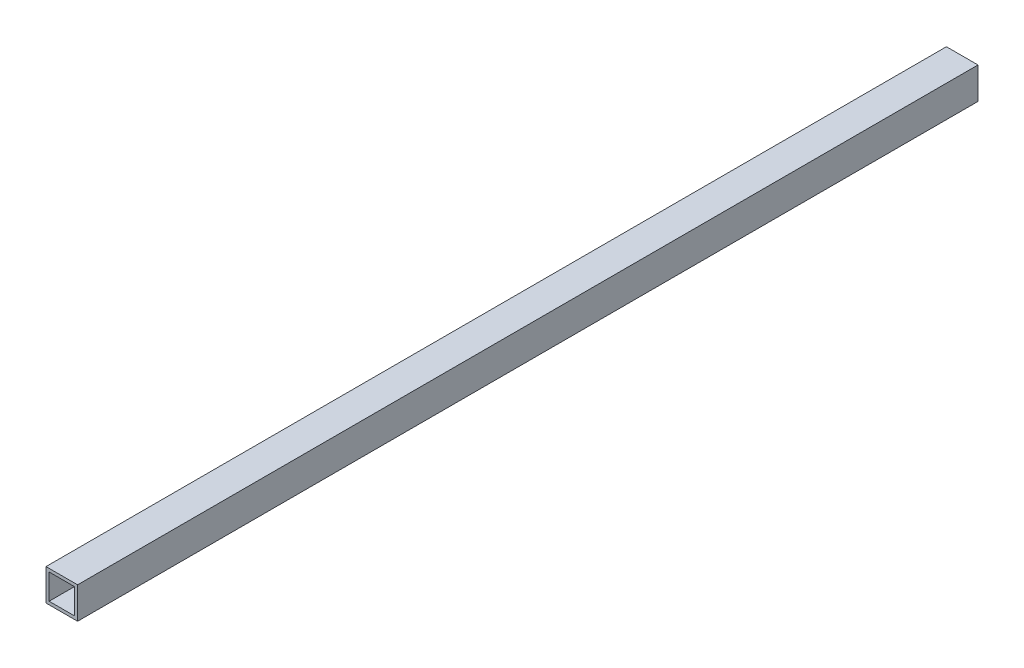
ISO-10303-21;
HEADER;
FILE_DESCRIPTION(('STEP AP214'),'2;1');
FILE_NAME('part.step','',(''),(''),'','','');
FILE_SCHEMA(('AUTOMOTIVE_DESIGN { 1 0 10303 214 1 1 1 1 }'));
ENDSEC;
DATA;
#1=APPLICATION_CONTEXT('core data for automotive mechanical design processes');
#2=APPLICATION_PROTOCOL_DEFINITION('international standard','automotive_design',2000,#1);
#3=PRODUCT_CONTEXT('',#1,'mechanical');
#4=PRODUCT('Part','Part','',(#3));
#5=PRODUCT_RELATED_PRODUCT_CATEGORY('part','',(#4));
#6=PRODUCT_DEFINITION_FORMATION('','',#4);
#7=PRODUCT_DEFINITION_CONTEXT('part definition',#1,'design');
#8=PRODUCT_DEFINITION('design','',#6,#7);
#9=PRODUCT_DEFINITION_SHAPE('','',#8);
#10=(LENGTH_UNIT() NAMED_UNIT(*) SI_UNIT(.MILLI.,.METRE.));
#11=(NAMED_UNIT(*) PLANE_ANGLE_UNIT() SI_UNIT($,.RADIAN.));
#12=(NAMED_UNIT(*) SI_UNIT($,.STERADIAN.) SOLID_ANGLE_UNIT());
#13=UNCERTAINTY_MEASURE_WITH_UNIT(LENGTH_MEASURE(1.E-05),#10,'distance_accuracy_value','');
#14=(GEOMETRIC_REPRESENTATION_CONTEXT(3) GLOBAL_UNCERTAINTY_ASSIGNED_CONTEXT((#13)) GLOBAL_UNIT_ASSIGNED_CONTEXT((#10,
#11,#12)) REPRESENTATION_CONTEXT('',''));
#15=CARTESIAN_POINT('',(0.,0.,0.));
#16=DIRECTION('',(0.,0.,1.));
#17=DIRECTION('',(1.,0.,0.));
#18=AXIS2_PLACEMENT_3D('',#15,#16,#17);
#19=CARTESIAN_POINT('',(0.,0.,570.));
#20=DIRECTION('',(0.,0.,1.));
#21=DIRECTION('',(1.,0.,0.));
#22=AXIS2_PLACEMENT_3D('',#19,#20,#21);
#23=PLANE('',#22);
#24=DIRECTION('',(0.,1.,0.));
#25=VECTOR('',#24,1.);
#26=CARTESIAN_POINT('',(10.,10.,570.));
#27=LINE('',#26,#25);
#28=CARTESIAN_POINT('',(10.,-10.,570.));
#29=VERTEX_POINT('',#28);
#30=CARTESIAN_POINT('',(10.,10.,570.));
#31=VERTEX_POINT('',#30);
#32=EDGE_CURVE('E153',#29,#31,#27,.T.);
#33=ORIENTED_EDGE('',*,*,#32,.T.);
#34=DIRECTION('',(-1.,0.,0.));
#35=VECTOR('',#34,1.);
#36=CARTESIAN_POINT('',(-10.,10.,570.));
#37=LINE('',#36,#35);
#38=CARTESIAN_POINT('',(-10.,10.,570.));
#39=VERTEX_POINT('',#38);
#40=EDGE_CURVE('E157',#31,#39,#37,.T.);
#41=ORIENTED_EDGE('',*,*,#40,.T.);
#42=DIRECTION('',(0.,-1.,0.));
#43=VECTOR('',#42,1.);
#44=CARTESIAN_POINT('',(-10.,10.,570.));
#45=LINE('',#44,#43);
#46=CARTESIAN_POINT('',(-10.,-10.,570.));
#47=VERTEX_POINT('',#46);
#48=EDGE_CURVE('E161',#39,#47,#45,.T.);
#49=ORIENTED_EDGE('',*,*,#48,.T.);
#50=DIRECTION('',(1.,0.,0.));
#51=VECTOR('',#50,1.);
#52=CARTESIAN_POINT('',(-10.,-10.,570.));
#53=LINE('',#52,#51);
#54=EDGE_CURVE('E164',#47,#29,#53,.T.);
#55=ORIENTED_EDGE('',*,*,#54,.T.);
#56=EDGE_LOOP('',(#33,#41,#49,#55));
#57=FACE_BOUND('',#56,.T.);
#58=DIRECTION('',(-1.,0.,0.));
#59=VECTOR('',#58,1.);
#60=CARTESIAN_POINT('',(-8.02113565673324,8.02113565673323,570.));
#61=LINE('',#60,#59);
#62=CARTESIAN_POINT('',(8.02113565673324,8.02113565673323,570.));
#63=VERTEX_POINT('',#62);
#64=CARTESIAN_POINT('',(-8.02113565673324,8.02113565673323,570.));
#65=VERTEX_POINT('',#64);
#66=EDGE_CURVE('E114',#63,#65,#61,.T.);
#67=ORIENTED_EDGE('',*,*,#66,.F.);
#68=DIRECTION('',(0.,1.,0.));
#69=VECTOR('',#68,1.);
#70=CARTESIAN_POINT('',(8.02113565673324,8.02113565673323,570.));
#71=LINE('',#70,#69);
#72=CARTESIAN_POINT('',(8.02113565673324,-8.02113565673323,570.));
#73=VERTEX_POINT('',#72);
#74=EDGE_CURVE('E105',#73,#63,#71,.T.);
#75=ORIENTED_EDGE('',*,*,#74,.F.);
#76=DIRECTION('',(1.,0.,0.));
#77=VECTOR('',#76,1.);
#78=CARTESIAN_POINT('',(-8.02113565673324,-8.02113565673323,570.));
#79=LINE('',#78,#77);
#80=CARTESIAN_POINT('',(-8.02113565673324,-8.02113565673323,570.));
#81=VERTEX_POINT('',#80);
#82=EDGE_CURVE('E131',#81,#73,#79,.T.);
#83=ORIENTED_EDGE('',*,*,#82,.F.);
#84=DIRECTION('',(0.,-1.,0.));
#85=VECTOR('',#84,1.);
#86=CARTESIAN_POINT('',(-8.02113565673324,8.02113565673323,570.));
#87=LINE('',#86,#85);
#88=EDGE_CURVE('E127',#65,#81,#87,.T.);
#89=ORIENTED_EDGE('',*,*,#88,.F.);
#90=EDGE_LOOP('',(#67,#75,#83,#89));
#91=FACE_BOUND('',#90,.T.);
#92=ADVANCED_FACE('F39',(#57,#91),#23,.T.);
#93=CARTESIAN_POINT('',(0.,0.,0.));
#94=DIRECTION('',(0.,0.,1.));
#95=DIRECTION('',(1.,0.,0.));
#96=AXIS2_PLACEMENT_3D('',#93,#94,#95);
#97=PLANE('',#96);
#98=DIRECTION('',(0.,1.,0.));
#99=VECTOR('',#98,1.);
#100=CARTESIAN_POINT('',(10.,10.,0.));
#101=LINE('',#100,#99);
#102=CARTESIAN_POINT('',(10.,-10.,0.));
#103=VERTEX_POINT('',#102);
#104=CARTESIAN_POINT('',(10.,10.,0.));
#105=VERTEX_POINT('',#104);
#106=EDGE_CURVE('E123',#103,#105,#101,.T.);
#107=ORIENTED_EDGE('',*,*,#106,.F.);
#108=DIRECTION('',(1.,0.,0.));
#109=VECTOR('',#108,1.);
#110=CARTESIAN_POINT('',(-10.,-10.,0.));
#111=LINE('',#110,#109);
#112=CARTESIAN_POINT('',(-10.,-10.,0.));
#113=VERTEX_POINT('',#112);
#114=EDGE_CURVE('E158',#113,#103,#111,.T.);
#115=ORIENTED_EDGE('',*,*,#114,.F.);
#116=DIRECTION('',(0.,-1.,0.));
#117=VECTOR('',#116,1.);
#118=CARTESIAN_POINT('',(-10.,10.,0.));
#119=LINE('',#118,#117);
#120=CARTESIAN_POINT('',(-10.,10.,0.));
#121=VERTEX_POINT('',#120);
#122=EDGE_CURVE('E174',#121,#113,#119,.T.);
#123=ORIENTED_EDGE('',*,*,#122,.F.);
#124=DIRECTION('',(-1.,0.,0.));
#125=VECTOR('',#124,1.);
#126=CARTESIAN_POINT('',(-10.,10.,0.));
#127=LINE('',#126,#125);
#128=EDGE_CURVE('E171',#105,#121,#127,.T.);
#129=ORIENTED_EDGE('',*,*,#128,.F.);
#130=EDGE_LOOP('',(#107,#115,#123,#129));
#131=FACE_BOUND('',#130,.T.);
#132=DIRECTION('',(0.,1.,0.));
#133=VECTOR('',#132,1.);
#134=CARTESIAN_POINT('',(8.02113565673324,8.02113565673323,0.));
#135=LINE('',#134,#133);
#136=CARTESIAN_POINT('',(8.02113565673324,-8.02113565673323,0.));
#137=VERTEX_POINT('',#136);
#138=CARTESIAN_POINT('',(8.02113565673324,8.02113565673323,0.));
#139=VERTEX_POINT('',#138);
#140=EDGE_CURVE('E63',#137,#139,#135,.T.);
#141=ORIENTED_EDGE('',*,*,#140,.T.);
#142=DIRECTION('',(-1.,0.,0.));
#143=VECTOR('',#142,1.);
#144=CARTESIAN_POINT('',(-8.02113565673324,8.02113565673323,0.));
#145=LINE('',#144,#143);
#146=CARTESIAN_POINT('',(-8.02113565673324,8.02113565673323,0.));
#147=VERTEX_POINT('',#146);
#148=EDGE_CURVE('E121',#139,#147,#145,.T.);
#149=ORIENTED_EDGE('',*,*,#148,.T.);
#150=DIRECTION('',(0.,-1.,0.));
#151=VECTOR('',#150,1.);
#152=CARTESIAN_POINT('',(-8.02113565673324,8.02113565673323,0.));
#153=LINE('',#152,#151);
#154=CARTESIAN_POINT('',(-8.02113565673324,-8.02113565673323,0.));
#155=VERTEX_POINT('',#154);
#156=EDGE_CURVE('E140',#147,#155,#153,.T.);
#157=ORIENTED_EDGE('',*,*,#156,.T.);
#158=DIRECTION('',(1.,0.,0.));
#159=VECTOR('',#158,1.);
#160=CARTESIAN_POINT('',(-8.02113565673324,-8.02113565673323,0.));
#161=LINE('',#160,#159);
#162=EDGE_CURVE('E115',#155,#137,#161,.T.);
#163=ORIENTED_EDGE('',*,*,#162,.T.);
#164=EDGE_LOOP('',(#141,#149,#157,#163));
#165=FACE_BOUND('',#164,.T.);
#166=ADVANCED_FACE('F197',(#131,#165),#97,.F.);
#167=CARTESIAN_POINT('',(10.,10.,570.));
#168=DIRECTION('',(-1.,0.,0.));
#169=DIRECTION('',(0.,0.,1.));
#170=AXIS2_PLACEMENT_3D('',#167,#168,#169);
#171=PLANE('',#170);
#172=ORIENTED_EDGE('',*,*,#106,.T.);
#173=DIRECTION('',(0.,0.,-1.));
#174=VECTOR('',#173,1.);
#175=CARTESIAN_POINT('',(10.,10.,570.));
#176=LINE('',#175,#174);
#177=EDGE_CURVE('E11',#31,#105,#176,.T.);
#178=ORIENTED_EDGE('',*,*,#177,.F.);
#179=ORIENTED_EDGE('',*,*,#32,.F.);
#180=DIRECTION('',(0.,0.,-1.));
#181=VECTOR('',#180,1.);
#182=CARTESIAN_POINT('',(10.,-10.,570.));
#183=LINE('',#182,#181);
#184=EDGE_CURVE('E167',#29,#103,#183,.T.);
#185=ORIENTED_EDGE('',*,*,#184,.T.);
#186=EDGE_LOOP('',(#172,#178,#179,#185));
#187=FACE_BOUND('',#186,.T.);
#188=ADVANCED_FACE('F41',(#187),#171,.F.);
#189=CARTESIAN_POINT('',(-10.,10.,570.));
#190=DIRECTION('',(0.,-1.,0.));
#191=DIRECTION('',(0.,0.,-1.));
#192=AXIS2_PLACEMENT_3D('',#189,#190,#191);
#193=PLANE('',#192);
#194=ORIENTED_EDGE('',*,*,#128,.T.);
#195=DIRECTION('',(0.,0.,-1.));
#196=VECTOR('',#195,1.);
#197=CARTESIAN_POINT('',(-10.,10.,570.));
#198=LINE('',#197,#196);
#199=EDGE_CURVE('E48',#39,#121,#198,.T.);
#200=ORIENTED_EDGE('',*,*,#199,.F.);
#201=ORIENTED_EDGE('',*,*,#40,.F.);
#202=ORIENTED_EDGE('',*,*,#177,.T.);
#203=EDGE_LOOP('',(#194,#200,#201,#202));
#204=FACE_BOUND('',#203,.T.);
#205=ADVANCED_FACE('F207',(#204),#193,.F.);
#206=CARTESIAN_POINT('',(-10.,10.,570.));
#207=DIRECTION('',(1.,0.,0.));
#208=DIRECTION('',(0.,0.,-1.));
#209=AXIS2_PLACEMENT_3D('',#206,#207,#208);
#210=PLANE('',#209);
#211=ORIENTED_EDGE('',*,*,#122,.T.);
#212=DIRECTION('',(0.,0.,-1.));
#213=VECTOR('',#212,1.);
#214=CARTESIAN_POINT('',(-10.,-10.,570.));
#215=LINE('',#214,#213);
#216=EDGE_CURVE('E182',#47,#113,#215,.T.);
#217=ORIENTED_EDGE('',*,*,#216,.F.);
#218=ORIENTED_EDGE('',*,*,#48,.F.);
#219=ORIENTED_EDGE('',*,*,#199,.T.);
#220=EDGE_LOOP('',(#211,#217,#218,#219));
#221=FACE_BOUND('',#220,.T.);
#222=ADVANCED_FACE('F191',(#221),#210,.F.);
#223=CARTESIAN_POINT('',(-10.,-10.,570.));
#224=DIRECTION('',(0.,1.,0.));
#225=DIRECTION('',(0.,0.,1.));
#226=AXIS2_PLACEMENT_3D('',#223,#224,#225);
#227=PLANE('',#226);
#228=ORIENTED_EDGE('',*,*,#114,.T.);
#229=ORIENTED_EDGE('',*,*,#184,.F.);
#230=ORIENTED_EDGE('',*,*,#54,.F.);
#231=ORIENTED_EDGE('',*,*,#216,.T.);
#232=EDGE_LOOP('',(#228,#229,#230,#231));
#233=FACE_BOUND('',#232,.T.);
#234=ADVANCED_FACE('F201',(#233),#227,.F.);
#235=CARTESIAN_POINT('',(8.02113565673324,8.02113565673323,570.));
#236=DIRECTION('',(-1.,0.,0.));
#237=DIRECTION('',(0.,0.,1.));
#238=AXIS2_PLACEMENT_3D('',#235,#236,#237);
#239=PLANE('',#238);
#240=ORIENTED_EDGE('',*,*,#140,.F.);
#241=DIRECTION('',(0.,0.,-1.));
#242=VECTOR('',#241,1.);
#243=CARTESIAN_POINT('',(8.02113565673324,-8.02113565673323,570.));
#244=LINE('',#243,#242);
#245=EDGE_CURVE('E109',#73,#137,#244,.T.);
#246=ORIENTED_EDGE('',*,*,#245,.F.);
#247=ORIENTED_EDGE('',*,*,#74,.T.);
#248=DIRECTION('',(0.,0.,-1.));
#249=VECTOR('',#248,1.);
#250=CARTESIAN_POINT('',(8.02113565673324,8.02113565673323,570.));
#251=LINE('',#250,#249);
#252=EDGE_CURVE('E108',#63,#139,#251,.T.);
#253=ORIENTED_EDGE('',*,*,#252,.T.);
#254=EDGE_LOOP('',(#240,#246,#247,#253));
#255=FACE_BOUND('',#254,.T.);
#256=ADVANCED_FACE('F107',(#255),#239,.T.);
#257=CARTESIAN_POINT('',(-8.02113565673324,8.02113565673323,570.));
#258=DIRECTION('',(0.,-1.,0.));
#259=DIRECTION('',(0.,0.,-1.));
#260=AXIS2_PLACEMENT_3D('',#257,#258,#259);
#261=PLANE('',#260);
#262=ORIENTED_EDGE('',*,*,#148,.F.);
#263=ORIENTED_EDGE('',*,*,#252,.F.);
#264=ORIENTED_EDGE('',*,*,#66,.T.);
#265=DIRECTION('',(0.,0.,-1.));
#266=VECTOR('',#265,1.);
#267=CARTESIAN_POINT('',(-8.02113565673324,8.02113565673323,570.));
#268=LINE('',#267,#266);
#269=EDGE_CURVE('E124',#65,#147,#268,.T.);
#270=ORIENTED_EDGE('',*,*,#269,.T.);
#271=EDGE_LOOP('',(#262,#263,#264,#270));
#272=FACE_BOUND('',#271,.T.);
#273=ADVANCED_FACE('F118',(#272),#261,.T.);
#274=CARTESIAN_POINT('',(-8.02113565673324,8.02113565673323,570.));
#275=DIRECTION('',(1.,0.,0.));
#276=DIRECTION('',(0.,0.,-1.));
#277=AXIS2_PLACEMENT_3D('',#274,#275,#276);
#278=PLANE('',#277);
#279=ORIENTED_EDGE('',*,*,#156,.F.);
#280=ORIENTED_EDGE('',*,*,#269,.F.);
#281=ORIENTED_EDGE('',*,*,#88,.T.);
#282=DIRECTION('',(0.,0.,-1.));
#283=VECTOR('',#282,1.);
#284=CARTESIAN_POINT('',(-8.02113565673324,-8.02113565673323,570.));
#285=LINE('',#284,#283);
#286=EDGE_CURVE('E55',#81,#155,#285,.T.);
#287=ORIENTED_EDGE('',*,*,#286,.T.);
#288=EDGE_LOOP('',(#279,#280,#281,#287));
#289=FACE_BOUND('',#288,.T.);
#290=ADVANCED_FACE('F230',(#289),#278,.T.);
#291=CARTESIAN_POINT('',(-8.02113565673324,-8.02113565673323,570.));
#292=DIRECTION('',(0.,1.,0.));
#293=DIRECTION('',(0.,0.,1.));
#294=AXIS2_PLACEMENT_3D('',#291,#292,#293);
#295=PLANE('',#294);
#296=ORIENTED_EDGE('',*,*,#162,.F.);
#297=ORIENTED_EDGE('',*,*,#286,.F.);
#298=ORIENTED_EDGE('',*,*,#82,.T.);
#299=ORIENTED_EDGE('',*,*,#245,.T.);
#300=EDGE_LOOP('',(#296,#297,#298,#299));
#301=FACE_BOUND('',#300,.T.);
#302=ADVANCED_FACE('F234',(#301),#295,.T.);
#303=CLOSED_SHELL('',(#92,#166,#188,#205,#222,#234,#256,#273,#290,#302));
#304=MANIFOLD_SOLID_BREP('B2',#303);
#305=ADVANCED_BREP_SHAPE_REPRESENTATION('',(#18,#304),#14);
#306=SHAPE_DEFINITION_REPRESENTATION(#9,#305);
ENDSEC;
END-ISO-10303-21;
